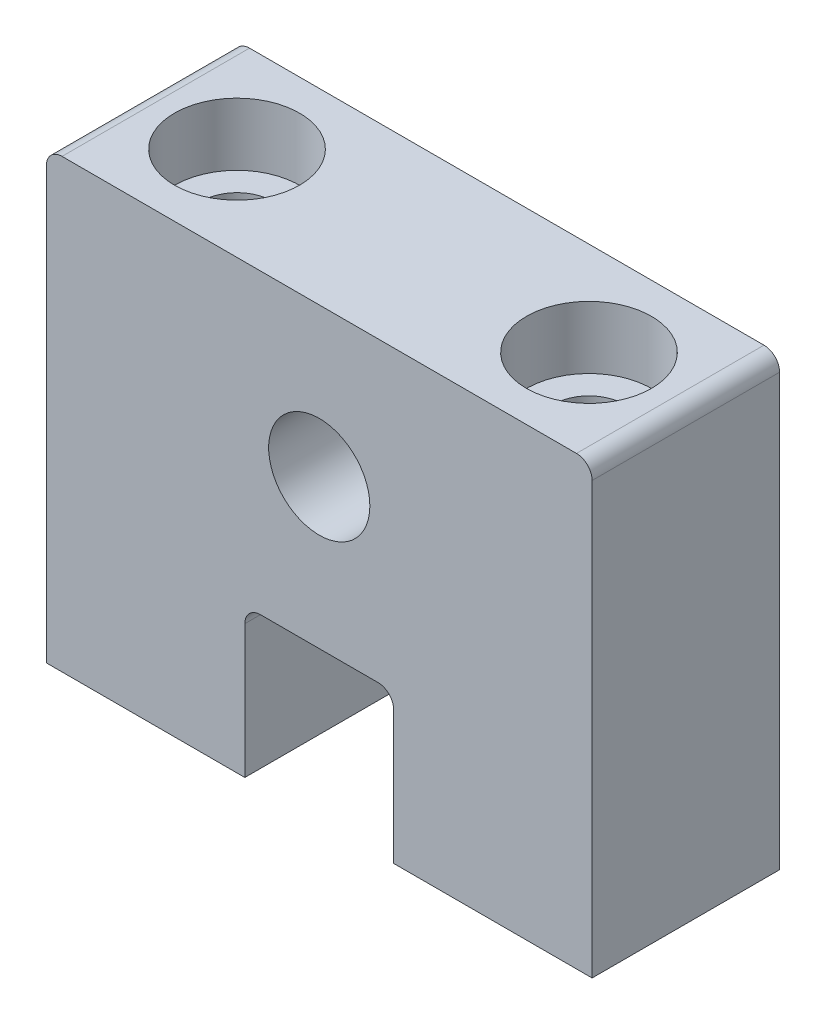
ISO-10303-21;
HEADER;
FILE_DESCRIPTION(('STEP AP214'),'2;1');
FILE_NAME('part.step','',(''),(''),'','','');
FILE_SCHEMA(('AUTOMOTIVE_DESIGN { 1 0 10303 214 1 1 1 1 }'));
ENDSEC;
DATA;
#1=APPLICATION_CONTEXT('core data for automotive mechanical design processes');
#2=APPLICATION_PROTOCOL_DEFINITION('international standard','automotive_design',2000,#1);
#3=PRODUCT_CONTEXT('',#1,'mechanical');
#4=PRODUCT('Part','Part','',(#3));
#5=PRODUCT_RELATED_PRODUCT_CATEGORY('part','',(#4));
#6=PRODUCT_DEFINITION_FORMATION('','',#4);
#7=PRODUCT_DEFINITION_CONTEXT('part definition',#1,'design');
#8=PRODUCT_DEFINITION('design','',#6,#7);
#9=PRODUCT_DEFINITION_SHAPE('','',#8);
#10=(LENGTH_UNIT() NAMED_UNIT(*) SI_UNIT(.MILLI.,.METRE.));
#11=(NAMED_UNIT(*) PLANE_ANGLE_UNIT() SI_UNIT($,.RADIAN.));
#12=(NAMED_UNIT(*) SI_UNIT($,.STERADIAN.) SOLID_ANGLE_UNIT());
#13=UNCERTAINTY_MEASURE_WITH_UNIT(LENGTH_MEASURE(1.E-05),#10,'distance_accuracy_value','');
#14=(GEOMETRIC_REPRESENTATION_CONTEXT(3) GLOBAL_UNCERTAINTY_ASSIGNED_CONTEXT((#13)) GLOBAL_UNIT_ASSIGNED_CONTEXT((#10,
#11,#12)) REPRESENTATION_CONTEXT('',''));
#15=CARTESIAN_POINT('',(0.,0.,0.));
#16=DIRECTION('',(0.,0.,1.));
#17=DIRECTION('',(1.,0.,0.));
#18=AXIS2_PLACEMENT_3D('',#15,#16,#17);
#19=CARTESIAN_POINT('',(0.,0.,12.));
#20=DIRECTION('',(0.,0.,-1.));
#21=DIRECTION('',(-1.,0.,0.));
#22=AXIS2_PLACEMENT_3D('',#19,#20,#21);
#23=PLANE('',#22);
#24=DIRECTION('',(0.,1.,0.));
#25=VECTOR('',#24,1.);
#26=CARTESIAN_POINT('',(17.4625,0.,12.));
#27=LINE('',#26,#25);
#28=CARTESIAN_POINT('',(17.4625,0.,12.));
#29=VERTEX_POINT('',#28);
#30=CARTESIAN_POINT('',(17.4625,27.575,12.));
#31=VERTEX_POINT('',#30);
#32=EDGE_CURVE('E178',#29,#31,#27,.T.);
#33=ORIENTED_EDGE('',*,*,#32,.T.);
#34=CARTESIAN_POINT('',(16.4625,27.575,12.));
#35=DIRECTION('',(0.,0.,-1.));
#36=DIRECTION('',(-1.,0.,0.));
#37=AXIS2_PLACEMENT_3D('',#34,#35,#36);
#38=CIRCLE('',#37,1.);
#39=CARTESIAN_POINT('',(16.4625,28.575,12.));
#40=VERTEX_POINT('',#39);
#41=EDGE_CURVE('E205',#31,#40,#38,.F.);
#42=ORIENTED_EDGE('',*,*,#41,.T.);
#43=DIRECTION('',(-1.,0.,0.));
#44=VECTOR('',#43,1.);
#45=CARTESIAN_POINT('',(-17.4625,28.575,12.));
#46=LINE('',#45,#44);
#47=CARTESIAN_POINT('',(-16.4625,28.575,12.));
#48=VERTEX_POINT('',#47);
#49=EDGE_CURVE('E131',#40,#48,#46,.T.);
#50=ORIENTED_EDGE('',*,*,#49,.T.);
#51=CARTESIAN_POINT('',(-16.4625,27.575,12.));
#52=DIRECTION('',(0.,0.,-1.));
#53=DIRECTION('',(-1.,0.,0.));
#54=AXIS2_PLACEMENT_3D('',#51,#52,#53);
#55=CIRCLE('',#54,1.);
#56=CARTESIAN_POINT('',(-17.4625,27.575,12.));
#57=VERTEX_POINT('',#56);
#58=EDGE_CURVE('E48',#48,#57,#55,.F.);
#59=ORIENTED_EDGE('',*,*,#58,.T.);
#60=DIRECTION('',(0.,-1.,0.));
#61=VECTOR('',#60,1.);
#62=CARTESIAN_POINT('',(-17.4625,0.,12.));
#63=LINE('',#62,#61);
#64=CARTESIAN_POINT('',(-17.4625,0.,12.));
#65=VERTEX_POINT('',#64);
#66=EDGE_CURVE('E121',#57,#65,#63,.T.);
#67=ORIENTED_EDGE('',*,*,#66,.T.);
#68=DIRECTION('',(1.,0.,0.));
#69=VECTOR('',#68,1.);
#70=CARTESIAN_POINT('',(-4.7625,0.,12.));
#71=LINE('',#70,#69);
#72=CARTESIAN_POINT('',(-4.7625,0.,12.));
#73=VERTEX_POINT('',#72);
#74=EDGE_CURVE('E126',#65,#73,#71,.T.);
#75=ORIENTED_EDGE('',*,*,#74,.T.);
#76=DIRECTION('',(0.,1.,0.));
#77=VECTOR('',#76,1.);
#78=CARTESIAN_POINT('',(-4.7625,0.,12.));
#79=LINE('',#78,#77);
#80=CARTESIAN_POINT('',(-4.7625,8.525,12.));
#81=VERTEX_POINT('',#80);
#82=EDGE_CURVE('E146',#73,#81,#79,.T.);
#83=ORIENTED_EDGE('',*,*,#82,.T.);
#84=CARTESIAN_POINT('',(-3.7625,8.525,12.));
#85=DIRECTION('',(0.,0.,-1.));
#86=DIRECTION('',(-1.,0.,0.));
#87=AXIS2_PLACEMENT_3D('',#84,#85,#86);
#88=CIRCLE('',#87,1.);
#89=CARTESIAN_POINT('',(-3.7625,9.525,12.));
#90=VERTEX_POINT('',#89);
#91=EDGE_CURVE('E11',#81,#90,#88,.T.);
#92=ORIENTED_EDGE('',*,*,#91,.T.);
#93=DIRECTION('',(1.,0.,0.));
#94=VECTOR('',#93,1.);
#95=CARTESIAN_POINT('',(-4.7625,9.525,12.));
#96=LINE('',#95,#94);
#97=CARTESIAN_POINT('',(3.76249999999999,9.525,12.));
#98=VERTEX_POINT('',#97);
#99=EDGE_CURVE('E148',#90,#98,#96,.T.);
#100=ORIENTED_EDGE('',*,*,#99,.T.);
#101=CARTESIAN_POINT('',(3.7625,8.52500000000001,12.));
#102=DIRECTION('',(0.,0.,-1.));
#103=DIRECTION('',(-1.,0.,0.));
#104=AXIS2_PLACEMENT_3D('',#101,#102,#103);
#105=CIRCLE('',#104,1.);
#106=CARTESIAN_POINT('',(4.7625,8.52500000000001,12.));
#107=VERTEX_POINT('',#106);
#108=EDGE_CURVE('E211',#98,#107,#105,.T.);
#109=ORIENTED_EDGE('',*,*,#108,.T.);
#110=DIRECTION('',(0.,-1.,0.));
#111=VECTOR('',#110,1.);
#112=CARTESIAN_POINT('',(4.7625,0.,12.));
#113=LINE('',#112,#111);
#114=CARTESIAN_POINT('',(4.7625,0.,12.));
#115=VERTEX_POINT('',#114);
#116=EDGE_CURVE('E154',#107,#115,#113,.T.);
#117=ORIENTED_EDGE('',*,*,#116,.T.);
#118=DIRECTION('',(1.,0.,0.));
#119=VECTOR('',#118,1.);
#120=CARTESIAN_POINT('',(4.7625,0.,12.));
#121=LINE('',#120,#119);
#122=EDGE_CURVE('E156',#115,#29,#121,.T.);
#123=ORIENTED_EDGE('',*,*,#122,.T.);
#124=EDGE_LOOP('',(#33,#42,#50,#59,#67,#75,#83,#92,#100,#109,#117,#123));
#125=FACE_BOUND('',#124,.T.);
#126=CARTESIAN_POINT('',(0.,19.05,12.));
#127=DIRECTION('',(0.,0.,1.));
#128=DIRECTION('',(1.,0.,0.));
#129=AXIS2_PLACEMENT_3D('',#126,#127,#128);
#130=CIRCLE('',#129,3.2385);
#131=CARTESIAN_POINT('',(3.2385,19.05,12.));
#132=VERTEX_POINT('',#131);
#133=EDGE_CURVE('E162',#132,#132,#130,.T.);
#134=ORIENTED_EDGE('',*,*,#133,.F.);
#135=EDGE_LOOP('',(#134));
#136=FACE_BOUND('',#135,.T.);
#137=ADVANCED_FACE('F33',(#125,#136),#23,.F.);
#138=CARTESIAN_POINT('',(0.,0.,0.));
#139=DIRECTION('',(0.,0.,-1.));
#140=DIRECTION('',(-1.,0.,0.));
#141=AXIS2_PLACEMENT_3D('',#138,#139,#140);
#142=PLANE('',#141);
#143=DIRECTION('',(-1.,0.,0.));
#144=VECTOR('',#143,1.);
#145=CARTESIAN_POINT('',(-17.4625,28.575,0.));
#146=LINE('',#145,#144);
#147=CARTESIAN_POINT('',(16.4625,28.575,0.));
#148=VERTEX_POINT('',#147);
#149=CARTESIAN_POINT('',(-16.4625,28.575,0.));
#150=VERTEX_POINT('',#149);
#151=EDGE_CURVE('E161',#148,#150,#146,.T.);
#152=ORIENTED_EDGE('',*,*,#151,.F.);
#153=CARTESIAN_POINT('',(16.4625,27.575,0.));
#154=DIRECTION('',(0.,0.,-1.));
#155=DIRECTION('',(-1.,0.,0.));
#156=AXIS2_PLACEMENT_3D('',#153,#154,#155);
#157=CIRCLE('',#156,1.);
#158=CARTESIAN_POINT('',(17.4625,27.575,0.));
#159=VERTEX_POINT('',#158);
#160=EDGE_CURVE('E201',#148,#159,#157,.T.);
#161=ORIENTED_EDGE('',*,*,#160,.T.);
#162=DIRECTION('',(0.,1.,0.));
#163=VECTOR('',#162,1.);
#164=CARTESIAN_POINT('',(17.4625,0.,0.));
#165=LINE('',#164,#163);
#166=CARTESIAN_POINT('',(17.4625,0.,0.));
#167=VERTEX_POINT('',#166);
#168=EDGE_CURVE('E159',#167,#159,#165,.T.);
#169=ORIENTED_EDGE('',*,*,#168,.F.);
#170=DIRECTION('',(1.,0.,0.));
#171=VECTOR('',#170,1.);
#172=CARTESIAN_POINT('',(4.7625,0.,0.));
#173=LINE('',#172,#171);
#174=CARTESIAN_POINT('',(4.7625,0.,0.));
#175=VERTEX_POINT('',#174);
#176=EDGE_CURVE('E176',#175,#167,#173,.T.);
#177=ORIENTED_EDGE('',*,*,#176,.F.);
#178=DIRECTION('',(0.,-1.,0.));
#179=VECTOR('',#178,1.);
#180=CARTESIAN_POINT('',(4.7625,0.,0.));
#181=LINE('',#180,#179);
#182=CARTESIAN_POINT('',(4.7625,8.52500000000001,0.));
#183=VERTEX_POINT('',#182);
#184=EDGE_CURVE('E174',#183,#175,#181,.T.);
#185=ORIENTED_EDGE('',*,*,#184,.F.);
#186=CARTESIAN_POINT('',(3.7625,8.52500000000001,0.));
#187=DIRECTION('',(0.,0.,-1.));
#188=DIRECTION('',(-1.,0.,0.));
#189=AXIS2_PLACEMENT_3D('',#186,#187,#188);
#190=CIRCLE('',#189,1.);
#191=CARTESIAN_POINT('',(3.76249999999999,9.525,0.));
#192=VERTEX_POINT('',#191);
#193=EDGE_CURVE('E209',#183,#192,#190,.F.);
#194=ORIENTED_EDGE('',*,*,#193,.T.);
#195=DIRECTION('',(1.,0.,0.));
#196=VECTOR('',#195,1.);
#197=CARTESIAN_POINT('',(-4.7625,9.525,0.));
#198=LINE('',#197,#196);
#199=CARTESIAN_POINT('',(-3.7625,9.525,0.));
#200=VERTEX_POINT('',#199);
#201=EDGE_CURVE('E171',#200,#192,#198,.T.);
#202=ORIENTED_EDGE('',*,*,#201,.F.);
#203=CARTESIAN_POINT('',(-3.7625,8.525,0.));
#204=DIRECTION('',(0.,0.,-1.));
#205=DIRECTION('',(-1.,0.,0.));
#206=AXIS2_PLACEMENT_3D('',#203,#204,#205);
#207=CIRCLE('',#206,1.);
#208=CARTESIAN_POINT('',(-4.7625,8.525,0.));
#209=VERTEX_POINT('',#208);
#210=EDGE_CURVE('E41',#200,#209,#207,.F.);
#211=ORIENTED_EDGE('',*,*,#210,.T.);
#212=DIRECTION('',(0.,1.,0.));
#213=VECTOR('',#212,1.);
#214=CARTESIAN_POINT('',(-4.7625,0.,0.));
#215=LINE('',#214,#213);
#216=CARTESIAN_POINT('',(-4.7625,0.,0.));
#217=VERTEX_POINT('',#216);
#218=EDGE_CURVE('E168',#217,#209,#215,.T.);
#219=ORIENTED_EDGE('',*,*,#218,.F.);
#220=DIRECTION('',(1.,0.,0.));
#221=VECTOR('',#220,1.);
#222=CARTESIAN_POINT('',(-4.7625,0.,0.));
#223=LINE('',#222,#221);
#224=CARTESIAN_POINT('',(-17.4625,0.,0.));
#225=VERTEX_POINT('',#224);
#226=EDGE_CURVE('E166',#225,#217,#223,.T.);
#227=ORIENTED_EDGE('',*,*,#226,.F.);
#228=DIRECTION('',(0.,-1.,0.));
#229=VECTOR('',#228,1.);
#230=CARTESIAN_POINT('',(-17.4625,0.,0.));
#231=LINE('',#230,#229);
#232=CARTESIAN_POINT('',(-17.4625,27.575,0.));
#233=VERTEX_POINT('',#232);
#234=EDGE_CURVE('E137',#233,#225,#231,.T.);
#235=ORIENTED_EDGE('',*,*,#234,.F.);
#236=CARTESIAN_POINT('',(-16.4625,27.575,0.));
#237=DIRECTION('',(0.,0.,-1.));
#238=DIRECTION('',(-1.,0.,0.));
#239=AXIS2_PLACEMENT_3D('',#236,#237,#238);
#240=CIRCLE('',#239,1.);
#241=EDGE_CURVE('E199',#233,#150,#240,.T.);
#242=ORIENTED_EDGE('',*,*,#241,.T.);
#243=EDGE_LOOP('',(#152,#161,#169,#177,#185,#194,#202,#211,#219,#227,#235,#242));
#244=FACE_BOUND('',#243,.T.);
#245=CARTESIAN_POINT('',(0.,19.05,0.));
#246=DIRECTION('',(0.,0.,1.));
#247=DIRECTION('',(1.,0.,0.));
#248=AXIS2_PLACEMENT_3D('',#245,#246,#247);
#249=CIRCLE('',#248,3.2385);
#250=CARTESIAN_POINT('',(3.2385,19.05,0.));
#251=VERTEX_POINT('',#250);
#252=EDGE_CURVE('E255',#251,#251,#249,.T.);
#253=ORIENTED_EDGE('',*,*,#252,.T.);
#254=EDGE_LOOP('',(#253));
#255=FACE_BOUND('',#254,.T.);
#256=ADVANCED_FACE('F216',(#244,#255),#142,.T.);
#257=CARTESIAN_POINT('',(17.4625,0.,12.));
#258=DIRECTION('',(-1.,0.,0.));
#259=DIRECTION('',(0.,0.,1.));
#260=AXIS2_PLACEMENT_3D('',#257,#258,#259);
#261=PLANE('',#260);
#262=ORIENTED_EDGE('',*,*,#168,.T.);
#263=DIRECTION('',(0.,0.,-1.));
#264=VECTOR('',#263,1.);
#265=CARTESIAN_POINT('',(17.4625,27.575,12.));
#266=LINE('',#265,#264);
#267=EDGE_CURVE('E56',#159,#31,#266,.F.);
#268=ORIENTED_EDGE('',*,*,#267,.T.);
#269=ORIENTED_EDGE('',*,*,#32,.F.);
#270=DIRECTION('',(0.,0.,-1.));
#271=VECTOR('',#270,1.);
#272=CARTESIAN_POINT('',(17.4625,0.,12.));
#273=LINE('',#272,#271);
#274=EDGE_CURVE('E158',#29,#167,#273,.T.);
#275=ORIENTED_EDGE('',*,*,#274,.T.);
#276=EDGE_LOOP('',(#262,#268,#269,#275));
#277=FACE_BOUND('',#276,.T.);
#278=ADVANCED_FACE('F289',(#277),#261,.F.);
#279=CARTESIAN_POINT('',(-17.4625,28.575,12.));
#280=DIRECTION('',(0.,-1.,0.));
#281=DIRECTION('',(0.,0.,-1.));
#282=AXIS2_PLACEMENT_3D('',#279,#280,#281);
#283=PLANE('',#282);
#284=CARTESIAN_POINT('',(-11.2625,28.575,6.));
#285=DIRECTION('',(0.,1.,0.));
#286=DIRECTION('',(0.,0.,1.));
#287=AXIS2_PLACEMENT_3D('',#284,#285,#286);
#288=CIRCLE('',#287,4.);
#289=CARTESIAN_POINT('',(-11.2625,28.575,10.));
#290=VERTEX_POINT('',#289);
#291=EDGE_CURVE('E281',#290,#290,#288,.T.);
#292=ORIENTED_EDGE('',*,*,#291,.F.);
#293=EDGE_LOOP('',(#292));
#294=FACE_BOUND('',#293,.T.);
#295=CARTESIAN_POINT('',(11.2625,28.575,6.));
#296=DIRECTION('',(0.,1.,0.));
#297=DIRECTION('',(0.,0.,1.));
#298=AXIS2_PLACEMENT_3D('',#295,#296,#297);
#299=CIRCLE('',#298,4.);
#300=CARTESIAN_POINT('',(11.2625,28.575,10.));
#301=VERTEX_POINT('',#300);
#302=EDGE_CURVE('E269',#301,#301,#299,.T.);
#303=ORIENTED_EDGE('',*,*,#302,.F.);
#304=EDGE_LOOP('',(#303));
#305=FACE_BOUND('',#304,.T.);
#306=ORIENTED_EDGE('',*,*,#49,.F.);
#307=DIRECTION('',(0.,0.,-1.));
#308=VECTOR('',#307,1.);
#309=CARTESIAN_POINT('',(16.4625,28.575,12.));
#310=LINE('',#309,#308);
#311=EDGE_CURVE('E196',#40,#148,#310,.T.);
#312=ORIENTED_EDGE('',*,*,#311,.T.);
#313=ORIENTED_EDGE('',*,*,#151,.T.);
#314=DIRECTION('',(0.,0.,-1.));
#315=VECTOR('',#314,1.);
#316=CARTESIAN_POINT('',(-16.4625,28.575,12.));
#317=LINE('',#316,#315);
#318=EDGE_CURVE('E194',#150,#48,#317,.F.);
#319=ORIENTED_EDGE('',*,*,#318,.T.);
#320=EDGE_LOOP('',(#306,#312,#313,#319));
#321=FACE_BOUND('',#320,.T.);
#322=ADVANCED_FACE('F250',(#294,#305,#321),#283,.F.);
#323=CARTESIAN_POINT('',(-17.4625,0.,12.));
#324=DIRECTION('',(1.,0.,0.));
#325=DIRECTION('',(0.,0.,-1.));
#326=AXIS2_PLACEMENT_3D('',#323,#324,#325);
#327=PLANE('',#326);
#328=ORIENTED_EDGE('',*,*,#66,.F.);
#329=DIRECTION('',(0.,0.,-1.));
#330=VECTOR('',#329,1.);
#331=CARTESIAN_POINT('',(-17.4625,27.575,12.));
#332=LINE('',#331,#330);
#333=EDGE_CURVE('E207',#57,#233,#332,.T.);
#334=ORIENTED_EDGE('',*,*,#333,.T.);
#335=ORIENTED_EDGE('',*,*,#234,.T.);
#336=DIRECTION('',(0.,0.,-1.));
#337=VECTOR('',#336,1.);
#338=CARTESIAN_POINT('',(-17.4625,0.,12.));
#339=LINE('',#338,#337);
#340=EDGE_CURVE('E134',#65,#225,#339,.T.);
#341=ORIENTED_EDGE('',*,*,#340,.F.);
#342=EDGE_LOOP('',(#328,#334,#335,#341));
#343=FACE_BOUND('',#342,.T.);
#344=ADVANCED_FACE('F135',(#343),#327,.F.);
#345=CARTESIAN_POINT('',(-4.7625,0.,12.));
#346=DIRECTION('',(0.,1.,0.));
#347=DIRECTION('',(-1.,0.,0.));
#348=AXIS2_PLACEMENT_3D('',#345,#346,#347);
#349=PLANE('',#348);
#350=CARTESIAN_POINT('',(-11.2625,0.,6.));
#351=DIRECTION('',(0.,1.,0.));
#352=DIRECTION('',(0.,0.,1.));
#353=AXIS2_PLACEMENT_3D('',#350,#351,#352);
#354=CIRCLE('',#353,2.24999999999999);
#355=CARTESIAN_POINT('',(-11.2625,0.,8.24999999999999));
#356=VERTEX_POINT('',#355);
#357=EDGE_CURVE('E272',#356,#356,#354,.T.);
#358=ORIENTED_EDGE('',*,*,#357,.T.);
#359=EDGE_LOOP('',(#358));
#360=FACE_BOUND('',#359,.T.);
#361=ORIENTED_EDGE('',*,*,#226,.T.);
#362=DIRECTION('',(0.,0.,-1.));
#363=VECTOR('',#362,1.);
#364=CARTESIAN_POINT('',(-4.7625,0.,12.));
#365=LINE('',#364,#363);
#366=EDGE_CURVE('E141',#73,#217,#365,.T.);
#367=ORIENTED_EDGE('',*,*,#366,.F.);
#368=ORIENTED_EDGE('',*,*,#74,.F.);
#369=ORIENTED_EDGE('',*,*,#340,.T.);
#370=EDGE_LOOP('',(#361,#367,#368,#369));
#371=FACE_BOUND('',#370,.T.);
#372=ADVANCED_FACE('F143',(#360,#371),#349,.F.);
#373=CARTESIAN_POINT('',(-4.7625,0.,12.));
#374=DIRECTION('',(-1.,0.,0.));
#375=DIRECTION('',(0.,-1.,0.));
#376=AXIS2_PLACEMENT_3D('',#373,#374,#375);
#377=PLANE('',#376);
#378=ORIENTED_EDGE('',*,*,#218,.T.);
#379=DIRECTION('',(0.,0.,-1.));
#380=VECTOR('',#379,1.);
#381=CARTESIAN_POINT('',(-4.7625,8.525,12.));
#382=LINE('',#381,#380);
#383=EDGE_CURVE('E192',#209,#81,#382,.F.);
#384=ORIENTED_EDGE('',*,*,#383,.T.);
#385=ORIENTED_EDGE('',*,*,#82,.F.);
#386=ORIENTED_EDGE('',*,*,#366,.T.);
#387=EDGE_LOOP('',(#378,#384,#385,#386));
#388=FACE_BOUND('',#387,.T.);
#389=ADVANCED_FACE('F222',(#388),#377,.F.);
#390=CARTESIAN_POINT('',(-4.7625,9.525,12.));
#391=DIRECTION('',(0.,1.,0.));
#392=DIRECTION('',(-1.,0.,0.));
#393=AXIS2_PLACEMENT_3D('',#390,#391,#392);
#394=PLANE('',#393);
#395=ORIENTED_EDGE('',*,*,#201,.T.);
#396=DIRECTION('',(0.,0.,-1.));
#397=VECTOR('',#396,1.);
#398=CARTESIAN_POINT('',(3.7625,9.525,12.));
#399=LINE('',#398,#397);
#400=EDGE_CURVE('E190',#192,#98,#399,.F.);
#401=ORIENTED_EDGE('',*,*,#400,.T.);
#402=ORIENTED_EDGE('',*,*,#99,.F.);
#403=DIRECTION('',(0.,0.,-1.));
#404=VECTOR('',#403,1.);
#405=CARTESIAN_POINT('',(-3.7625,9.525,0.));
#406=LINE('',#405,#404);
#407=EDGE_CURVE('E187',#90,#200,#406,.T.);
#408=ORIENTED_EDGE('',*,*,#407,.T.);
#409=EDGE_LOOP('',(#395,#401,#402,#408));
#410=FACE_BOUND('',#409,.T.);
#411=ADVANCED_FACE('F228',(#410),#394,.F.);
#412=CARTESIAN_POINT('',(4.7625,0.,12.));
#413=DIRECTION('',(1.,0.,0.));
#414=DIRECTION('',(0.,1.,0.));
#415=AXIS2_PLACEMENT_3D('',#412,#413,#414);
#416=PLANE('',#415);
#417=ORIENTED_EDGE('',*,*,#116,.F.);
#418=DIRECTION('',(0.,0.,-1.));
#419=VECTOR('',#418,1.);
#420=CARTESIAN_POINT('',(4.7625,8.52500000000001,0.));
#421=LINE('',#420,#419);
#422=EDGE_CURVE('E140',#107,#183,#421,.T.);
#423=ORIENTED_EDGE('',*,*,#422,.T.);
#424=ORIENTED_EDGE('',*,*,#184,.T.);
#425=DIRECTION('',(0.,0.,-1.));
#426=VECTOR('',#425,1.);
#427=CARTESIAN_POINT('',(4.7625,0.,12.));
#428=LINE('',#427,#426);
#429=EDGE_CURVE('E181',#115,#175,#428,.T.);
#430=ORIENTED_EDGE('',*,*,#429,.F.);
#431=EDGE_LOOP('',(#417,#423,#424,#430));
#432=FACE_BOUND('',#431,.T.);
#433=ADVANCED_FACE('F236',(#432),#416,.F.);
#434=CARTESIAN_POINT('',(4.7625,0.,12.));
#435=DIRECTION('',(0.,1.,0.));
#436=DIRECTION('',(-1.,0.,0.));
#437=AXIS2_PLACEMENT_3D('',#434,#435,#436);
#438=PLANE('',#437);
#439=CARTESIAN_POINT('',(11.2625,0.,6.));
#440=DIRECTION('',(0.,1.,0.));
#441=DIRECTION('',(0.,0.,1.));
#442=AXIS2_PLACEMENT_3D('',#439,#440,#441);
#443=CIRCLE('',#442,2.24999999999999);
#444=CARTESIAN_POINT('',(11.2625,0.,8.24999999999999));
#445=VERTEX_POINT('',#444);
#446=EDGE_CURVE('E258',#445,#445,#443,.T.);
#447=ORIENTED_EDGE('',*,*,#446,.T.);
#448=EDGE_LOOP('',(#447));
#449=FACE_BOUND('',#448,.T.);
#450=ORIENTED_EDGE('',*,*,#176,.T.);
#451=ORIENTED_EDGE('',*,*,#274,.F.);
#452=ORIENTED_EDGE('',*,*,#122,.F.);
#453=ORIENTED_EDGE('',*,*,#429,.T.);
#454=EDGE_LOOP('',(#450,#451,#452,#453));
#455=FACE_BOUND('',#454,.T.);
#456=ADVANCED_FACE('F242',(#449,#455),#438,.F.);
#457=CARTESIAN_POINT('',(0.,19.05,12.));
#458=DIRECTION('',(0.,0.,-1.));
#459=DIRECTION('',(-1.,0.,0.));
#460=AXIS2_PLACEMENT_3D('',#457,#458,#459);
#461=CYLINDRICAL_SURFACE('',#460,3.2385);
#462=ORIENTED_EDGE('',*,*,#133,.T.);
#463=EDGE_LOOP('',(#462));
#464=FACE_BOUND('',#463,.T.);
#465=ORIENTED_EDGE('',*,*,#252,.F.);
#466=EDGE_LOOP('',(#465));
#467=FACE_BOUND('',#466,.T.);
#468=ADVANCED_FACE('F317',(#464,#467),#461,.F.);
#469=CARTESIAN_POINT('',(11.2625,28.575,6.));
#470=DIRECTION('',(0.,1.,0.));
#471=DIRECTION('',(0.,0.,1.));
#472=AXIS2_PLACEMENT_3D('',#469,#470,#471);
#473=CYLINDRICAL_SURFACE('',#472,2.25);
#474=ORIENTED_EDGE('',*,*,#446,.F.);
#475=EDGE_LOOP('',(#474));
#476=FACE_BOUND('',#475,.T.);
#477=CARTESIAN_POINT('',(11.2625,24.575,6.));
#478=DIRECTION('',(0.,1.,0.));
#479=DIRECTION('',(0.,0.,1.));
#480=AXIS2_PLACEMENT_3D('',#477,#478,#479);
#481=CIRCLE('',#480,2.25);
#482=CARTESIAN_POINT('',(11.2625,24.575,8.25));
#483=VERTEX_POINT('',#482);
#484=EDGE_CURVE('E263',#483,#483,#481,.T.);
#485=ORIENTED_EDGE('',*,*,#484,.T.);
#486=EDGE_LOOP('',(#485));
#487=FACE_BOUND('',#486,.T.);
#488=ADVANCED_FACE('F306',(#476,#487),#473,.F.);
#489=CARTESIAN_POINT('',(13.5125,24.575,6.));
#490=DIRECTION('',(0.,-1.,0.));
#491=DIRECTION('',(0.,0.,-1.));
#492=AXIS2_PLACEMENT_3D('',#489,#490,#491);
#493=PLANE('',#492);
#494=ORIENTED_EDGE('',*,*,#484,.F.);
#495=EDGE_LOOP('',(#494));
#496=FACE_BOUND('',#495,.T.);
#497=CARTESIAN_POINT('',(11.2625,24.575,6.));
#498=DIRECTION('',(0.,1.,0.));
#499=DIRECTION('',(0.,0.,1.));
#500=AXIS2_PLACEMENT_3D('',#497,#498,#499);
#501=CIRCLE('',#500,4.);
#502=CARTESIAN_POINT('',(11.2625,24.575,10.));
#503=VERTEX_POINT('',#502);
#504=EDGE_CURVE('E266',#503,#503,#501,.T.);
#505=ORIENTED_EDGE('',*,*,#504,.T.);
#506=EDGE_LOOP('',(#505));
#507=FACE_BOUND('',#506,.T.);
#508=ADVANCED_FACE('F296',(#496,#507),#493,.F.);
#509=CARTESIAN_POINT('',(11.2625,28.575,6.));
#510=DIRECTION('',(0.,1.,0.));
#511=DIRECTION('',(0.,0.,1.));
#512=AXIS2_PLACEMENT_3D('',#509,#510,#511);
#513=CYLINDRICAL_SURFACE('',#512,4.);
#514=ORIENTED_EDGE('',*,*,#504,.F.);
#515=EDGE_LOOP('',(#514));
#516=FACE_BOUND('',#515,.T.);
#517=ORIENTED_EDGE('',*,*,#302,.T.);
#518=EDGE_LOOP('',(#517));
#519=FACE_BOUND('',#518,.T.);
#520=ADVANCED_FACE('F293',(#516,#519),#513,.F.);
#521=CARTESIAN_POINT('',(-11.2625,28.575,6.));
#522=DIRECTION('',(0.,1.,0.));
#523=DIRECTION('',(0.,0.,1.));
#524=AXIS2_PLACEMENT_3D('',#521,#522,#523);
#525=CYLINDRICAL_SURFACE('',#524,2.25);
#526=ORIENTED_EDGE('',*,*,#357,.F.);
#527=EDGE_LOOP('',(#526));
#528=FACE_BOUND('',#527,.T.);
#529=CARTESIAN_POINT('',(-11.2625,24.575,6.));
#530=DIRECTION('',(0.,1.,0.));
#531=DIRECTION('',(0.,0.,1.));
#532=AXIS2_PLACEMENT_3D('',#529,#530,#531);
#533=CIRCLE('',#532,2.25);
#534=CARTESIAN_POINT('',(-11.2625,24.575,8.25));
#535=VERTEX_POINT('',#534);
#536=EDGE_CURVE('E275',#535,#535,#533,.T.);
#537=ORIENTED_EDGE('',*,*,#536,.T.);
#538=EDGE_LOOP('',(#537));
#539=FACE_BOUND('',#538,.T.);
#540=ADVANCED_FACE('F295',(#528,#539),#525,.F.);
#541=CARTESIAN_POINT('',(-9.0125,24.575,6.));
#542=DIRECTION('',(0.,-1.,0.));
#543=DIRECTION('',(0.,0.,-1.));
#544=AXIS2_PLACEMENT_3D('',#541,#542,#543);
#545=PLANE('',#544);
#546=ORIENTED_EDGE('',*,*,#536,.F.);
#547=EDGE_LOOP('',(#546));
#548=FACE_BOUND('',#547,.T.);
#549=CARTESIAN_POINT('',(-11.2625,24.575,6.));
#550=DIRECTION('',(0.,1.,0.));
#551=DIRECTION('',(0.,0.,1.));
#552=AXIS2_PLACEMENT_3D('',#549,#550,#551);
#553=CIRCLE('',#552,4.);
#554=CARTESIAN_POINT('',(-11.2625,24.575,10.));
#555=VERTEX_POINT('',#554);
#556=EDGE_CURVE('E278',#555,#555,#553,.T.);
#557=ORIENTED_EDGE('',*,*,#556,.T.);
#558=EDGE_LOOP('',(#557));
#559=FACE_BOUND('',#558,.T.);
#560=ADVANCED_FACE('F303',(#548,#559),#545,.F.);
#561=CARTESIAN_POINT('',(-11.2625,28.575,6.));
#562=DIRECTION('',(0.,1.,0.));
#563=DIRECTION('',(0.,0.,1.));
#564=AXIS2_PLACEMENT_3D('',#561,#562,#563);
#565=CYLINDRICAL_SURFACE('',#564,4.);
#566=ORIENTED_EDGE('',*,*,#556,.F.);
#567=EDGE_LOOP('',(#566));
#568=FACE_BOUND('',#567,.T.);
#569=ORIENTED_EDGE('',*,*,#291,.T.);
#570=EDGE_LOOP('',(#569));
#571=FACE_BOUND('',#570,.T.);
#572=ADVANCED_FACE('F285',(#568,#571),#565,.F.);
#573=CARTESIAN_POINT('',(3.7625,8.52500000000001,12.));
#574=DIRECTION('',(0.,0.,1.));
#575=DIRECTION('',(1.,0.,0.));
#576=AXIS2_PLACEMENT_3D('',#573,#574,#575);
#577=CYLINDRICAL_SURFACE('',#576,1.);
#578=ORIENTED_EDGE('',*,*,#108,.F.);
#579=ORIENTED_EDGE('',*,*,#400,.F.);
#580=ORIENTED_EDGE('',*,*,#193,.F.);
#581=ORIENTED_EDGE('',*,*,#422,.F.);
#582=EDGE_LOOP('',(#578,#579,#580,#581));
#583=FACE_BOUND('',#582,.T.);
#584=ADVANCED_FACE('F231',(#583),#577,.F.);
#585=CARTESIAN_POINT('',(-3.7625,8.525,12.));
#586=DIRECTION('',(0.,0.,1.));
#587=DIRECTION('',(1.,0.,0.));
#588=AXIS2_PLACEMENT_3D('',#585,#586,#587);
#589=CYLINDRICAL_SURFACE('',#588,1.);
#590=ORIENTED_EDGE('',*,*,#91,.F.);
#591=ORIENTED_EDGE('',*,*,#383,.F.);
#592=ORIENTED_EDGE('',*,*,#210,.F.);
#593=ORIENTED_EDGE('',*,*,#407,.F.);
#594=EDGE_LOOP('',(#590,#591,#592,#593));
#595=FACE_BOUND('',#594,.T.);
#596=ADVANCED_FACE('F224',(#595),#589,.F.);
#597=CARTESIAN_POINT('',(16.4625,27.575,12.));
#598=DIRECTION('',(0.,0.,-1.));
#599=DIRECTION('',(-1.,0.,0.));
#600=AXIS2_PLACEMENT_3D('',#597,#598,#599);
#601=CYLINDRICAL_SURFACE('',#600,1.);
#602=ORIENTED_EDGE('',*,*,#41,.F.);
#603=ORIENTED_EDGE('',*,*,#267,.F.);
#604=ORIENTED_EDGE('',*,*,#160,.F.);
#605=ORIENTED_EDGE('',*,*,#311,.F.);
#606=EDGE_LOOP('',(#602,#603,#604,#605));
#607=FACE_BOUND('',#606,.T.);
#608=ADVANCED_FACE('F248',(#607),#601,.T.);
#609=CARTESIAN_POINT('',(-16.4625,27.575,12.));
#610=DIRECTION('',(0.,0.,-1.));
#611=DIRECTION('',(-1.,0.,0.));
#612=AXIS2_PLACEMENT_3D('',#609,#610,#611);
#613=CYLINDRICAL_SURFACE('',#612,1.);
#614=ORIENTED_EDGE('',*,*,#58,.F.);
#615=ORIENTED_EDGE('',*,*,#318,.F.);
#616=ORIENTED_EDGE('',*,*,#241,.F.);
#617=ORIENTED_EDGE('',*,*,#333,.F.);
#618=EDGE_LOOP('',(#614,#615,#616,#617));
#619=FACE_BOUND('',#618,.T.);
#620=ADVANCED_FACE('F35',(#619),#613,.T.);
#621=CLOSED_SHELL('',(#137,#256,#278,#322,#344,#372,#389,#411,#433,#456,#468,#488,#508,#520,
#540,#560,#572,#584,#596,#608,#620));
#622=MANIFOLD_SOLID_BREP('B2',#621);
#623=ADVANCED_BREP_SHAPE_REPRESENTATION('',(#18,#622),#14);
#624=SHAPE_DEFINITION_REPRESENTATION(#9,#623);
ENDSEC;
END-ISO-10303-21;
